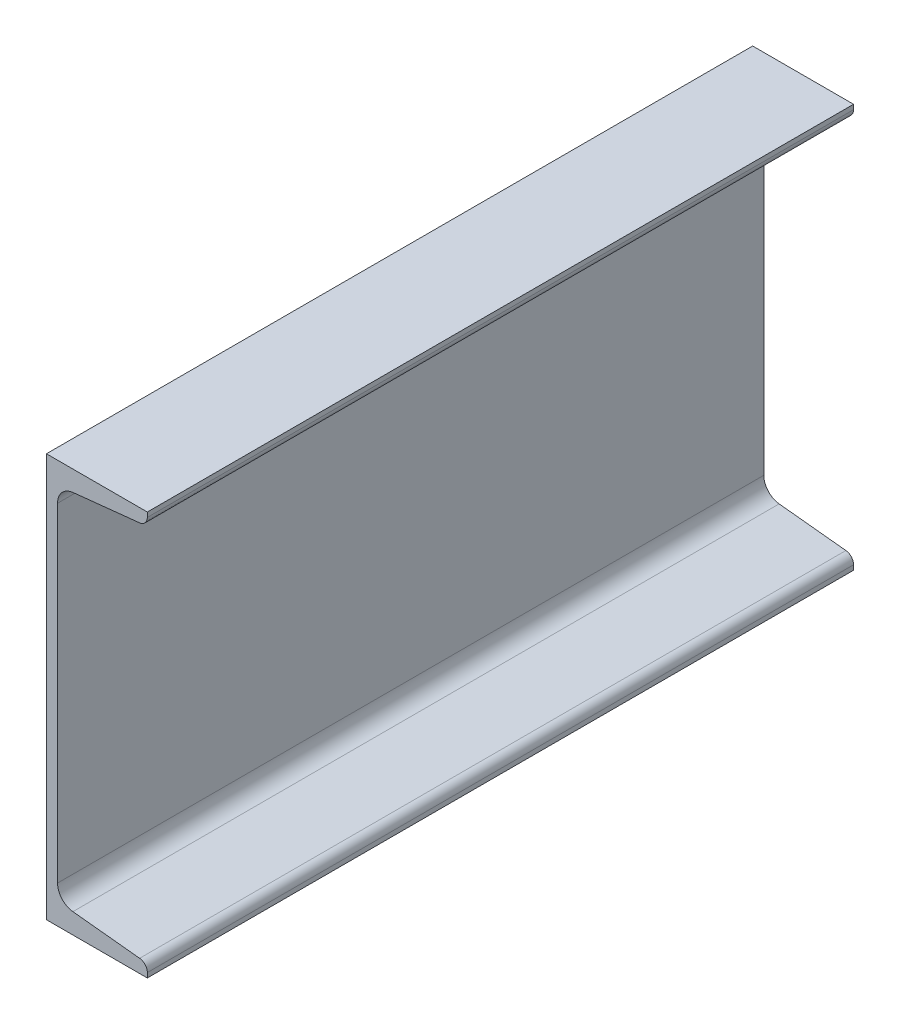
ISO-10303-21;
HEADER;
FILE_DESCRIPTION(('STEP AP214'),'2;1');
FILE_NAME('part.step','',(''),(''),'','','');
FILE_SCHEMA(('AUTOMOTIVE_DESIGN { 1 0 10303 214 1 1 1 1 }'));
ENDSEC;
DATA;
#1=APPLICATION_CONTEXT('core data for automotive mechanical design processes');
#2=APPLICATION_PROTOCOL_DEFINITION('international standard','automotive_design',2000,#1);
#3=PRODUCT_CONTEXT('',#1,'mechanical');
#4=PRODUCT('Part','Part','',(#3));
#5=PRODUCT_RELATED_PRODUCT_CATEGORY('part','',(#4));
#6=PRODUCT_DEFINITION_FORMATION('','',#4);
#7=PRODUCT_DEFINITION_CONTEXT('part definition',#1,'design');
#8=PRODUCT_DEFINITION('design','',#6,#7);
#9=PRODUCT_DEFINITION_SHAPE('','',#8);
#10=(LENGTH_UNIT() NAMED_UNIT(*) SI_UNIT(.MILLI.,.METRE.));
#11=(NAMED_UNIT(*) PLANE_ANGLE_UNIT() SI_UNIT($,.RADIAN.));
#12=(NAMED_UNIT(*) SI_UNIT($,.STERADIAN.) SOLID_ANGLE_UNIT());
#13=UNCERTAINTY_MEASURE_WITH_UNIT(LENGTH_MEASURE(1.E-05),#10,'distance_accuracy_value','');
#14=(GEOMETRIC_REPRESENTATION_CONTEXT(3) GLOBAL_UNCERTAINTY_ASSIGNED_CONTEXT((#13)) GLOBAL_UNIT_ASSIGNED_CONTEXT((#10,
#11,#12)) REPRESENTATION_CONTEXT('',''));
#15=CARTESIAN_POINT('',(0.,0.,0.));
#16=DIRECTION('',(0.,0.,1.));
#17=DIRECTION('',(1.,0.,0.));
#18=AXIS2_PLACEMENT_3D('',#15,#16,#17);
#19=CARTESIAN_POINT('',(1.24061045047754E-13,400.,350.));
#20=DIRECTION('',(1.,0.,0.));
#21=DIRECTION('',(0.,1.,0.));
#22=AXIS2_PLACEMENT_3D('',#19,#20,#21);
#23=PLANE('',#22);
#24=DIRECTION('',(0.,-1.,0.));
#25=VECTOR('',#24,1.);
#26=CARTESIAN_POINT('',(1.24061045047754E-13,400.,-350.));
#27=LINE('',#26,#25);
#28=CARTESIAN_POINT('',(1.24061045047754E-13,400.,-350.));
#29=VERTEX_POINT('',#28);
#30=CARTESIAN_POINT('',(0.,0.,-350.));
#31=VERTEX_POINT('',#30);
#32=EDGE_CURVE('E142',#29,#31,#27,.T.);
#33=ORIENTED_EDGE('',*,*,#32,.T.);
#34=DIRECTION('',(0.,0.,-1.));
#35=VECTOR('',#34,1.);
#36=CARTESIAN_POINT('',(0.,0.,350.));
#37=LINE('',#36,#35);
#38=CARTESIAN_POINT('',(0.,0.,350.));
#39=VERTEX_POINT('',#38);
#40=EDGE_CURVE('E140',#39,#31,#37,.T.);
#41=ORIENTED_EDGE('',*,*,#40,.F.);
#42=DIRECTION('',(0.,-1.,0.));
#43=VECTOR('',#42,1.);
#44=CARTESIAN_POINT('',(1.24061045047754E-13,400.,350.));
#45=LINE('',#44,#43);
#46=CARTESIAN_POINT('',(1.24061045047754E-13,400.,350.));
#47=VERTEX_POINT('',#46);
#48=EDGE_CURVE('E126',#47,#39,#45,.T.);
#49=ORIENTED_EDGE('',*,*,#48,.F.);
#50=DIRECTION('',(0.,0.,-1.));
#51=VECTOR('',#50,1.);
#52=CARTESIAN_POINT('',(1.24061045047754E-13,400.,350.));
#53=LINE('',#52,#51);
#54=EDGE_CURVE('E171',#47,#29,#53,.T.);
#55=ORIENTED_EDGE('',*,*,#54,.T.);
#56=EDGE_LOOP('',(#33,#41,#49,#55));
#57=FACE_BOUND('',#56,.T.);
#58=ADVANCED_FACE('F37',(#57),#23,.F.);
#59=CARTESIAN_POINT('',(100.,0.,350.));
#60=DIRECTION('',(0.,-1.,0.));
#61=DIRECTION('',(1.,0.,0.));
#62=AXIS2_PLACEMENT_3D('',#59,#60,#61);
#63=PLANE('',#62);
#64=DIRECTION('',(-1.,0.,0.));
#65=VECTOR('',#64,1.);
#66=CARTESIAN_POINT('',(100.,0.,-350.));
#67=LINE('',#66,#65);
#68=CARTESIAN_POINT('',(100.,0.,-350.));
#69=VERTEX_POINT('',#68);
#70=EDGE_CURVE('E173',#69,#31,#67,.T.);
#71=ORIENTED_EDGE('',*,*,#70,.F.);
#72=DIRECTION('',(0.,0.,-1.));
#73=VECTOR('',#72,1.);
#74=CARTESIAN_POINT('',(100.,0.,350.));
#75=LINE('',#74,#73);
#76=CARTESIAN_POINT('',(100.,0.,350.));
#77=VERTEX_POINT('',#76);
#78=EDGE_CURVE('E147',#77,#69,#75,.T.);
#79=ORIENTED_EDGE('',*,*,#78,.F.);
#80=DIRECTION('',(-1.,0.,0.));
#81=VECTOR('',#80,1.);
#82=CARTESIAN_POINT('',(100.,0.,350.));
#83=LINE('',#82,#81);
#84=EDGE_CURVE('E131',#77,#39,#83,.T.);
#85=ORIENTED_EDGE('',*,*,#84,.T.);
#86=ORIENTED_EDGE('',*,*,#40,.T.);
#87=EDGE_LOOP('',(#71,#79,#85,#86));
#88=FACE_BOUND('',#87,.T.);
#89=ADVANCED_FACE('F149',(#88),#63,.T.);
#90=CARTESIAN_POINT('',(100.,0.,350.));
#91=DIRECTION('',(-1.,0.,0.));
#92=DIRECTION('',(0.,-1.,0.));
#93=AXIS2_PLACEMENT_3D('',#90,#91,#92);
#94=PLANE('',#93);
#95=DIRECTION('',(0.,1.,0.));
#96=VECTOR('',#95,1.);
#97=CARTESIAN_POINT('',(100.,0.,-350.));
#98=LINE('',#97,#96);
#99=CARTESIAN_POINT('',(100.,4.66942715060426,-350.));
#100=VERTEX_POINT('',#99);
#101=EDGE_CURVE('E175',#69,#100,#98,.T.);
#102=ORIENTED_EDGE('',*,*,#101,.T.);
#103=DIRECTION('',(0.,0.,-1.));
#104=VECTOR('',#103,1.);
#105=CARTESIAN_POINT('',(100.,4.66942715060426,350.));
#106=LINE('',#105,#104);
#107=CARTESIAN_POINT('',(100.,4.66942715060426,350.));
#108=VERTEX_POINT('',#107);
#109=EDGE_CURVE('E214',#100,#108,#106,.F.);
#110=ORIENTED_EDGE('',*,*,#109,.T.);
#111=DIRECTION('',(0.,1.,0.));
#112=VECTOR('',#111,1.);
#113=CARTESIAN_POINT('',(100.,0.,350.));
#114=LINE('',#113,#112);
#115=EDGE_CURVE('E151',#77,#108,#114,.T.);
#116=ORIENTED_EDGE('',*,*,#115,.F.);
#117=ORIENTED_EDGE('',*,*,#78,.T.);
#118=EDGE_LOOP('',(#102,#110,#116,#117));
#119=FACE_BOUND('',#118,.T.);
#120=ADVANCED_FACE('F245',(#119),#94,.F.);
#121=CARTESIAN_POINT('',(26.22301612445,20.0771349975833,350.));
#122=DIRECTION('',(0.104528463267647,0.994521895368274,0.));
#123=DIRECTION('',(-0.994521895368274,0.104528463267647,0.));
#124=AXIS2_PLACEMENT_3D('',#121,#122,#123);
#125=PLANE('',#124);
#126=DIRECTION('',(0.994521895368274,-0.104528463267647,0.));
#127=VECTOR('',#126,1.);
#128=CARTESIAN_POINT('',(26.22301612445,20.0771349975833,350.));
#129=LINE('',#128,#127);
#130=CARTESIAN_POINT('',(26.22301612445,20.0771349975833,350.));
#131=VERTEX_POINT('',#130);
#132=CARTESIAN_POINT('',(92.388491937775,13.1228632612346,350.));
#133=VERTEX_POINT('',#132);
#134=EDGE_CURVE('E153',#131,#133,#129,.T.);
#135=ORIENTED_EDGE('',*,*,#134,.T.);
#136=DIRECTION('',(0.,0.,-1.));
#137=VECTOR('',#136,1.);
#138=CARTESIAN_POINT('',(92.388491937775,13.1228632612346,-350.));
#139=LINE('',#138,#137);
#140=CARTESIAN_POINT('',(92.388491937775,13.1228632612346,-350.));
#141=VERTEX_POINT('',#140);
#142=EDGE_CURVE('E146',#133,#141,#139,.T.);
#143=ORIENTED_EDGE('',*,*,#142,.T.);
#144=DIRECTION('',(0.994521895368274,-0.104528463267647,0.));
#145=VECTOR('',#144,1.);
#146=CARTESIAN_POINT('',(26.22301612445,20.0771349975833,-350.));
#147=LINE('',#146,#145);
#148=CARTESIAN_POINT('',(26.22301612445,20.0771349975833,-350.));
#149=VERTEX_POINT('',#148);
#150=EDGE_CURVE('E178',#149,#141,#147,.T.);
#151=ORIENTED_EDGE('',*,*,#150,.F.);
#152=DIRECTION('',(0.,0.,-1.));
#153=VECTOR('',#152,1.);
#154=CARTESIAN_POINT('',(26.22301612445,20.0771349975833,350.));
#155=LINE('',#154,#153);
#156=EDGE_CURVE('E205',#131,#149,#155,.T.);
#157=ORIENTED_EDGE('',*,*,#156,.F.);
#158=EDGE_LOOP('',(#135,#143,#151,#157));
#159=FACE_BOUND('',#158,.T.);
#160=ADVANCED_FACE('F261',(#159),#125,.T.);
#161=CARTESIAN_POINT('',(28.,36.9840072188439,350.));
#162=DIRECTION('',(0.,0.,-1.));
#163=DIRECTION('',(-1.,0.,0.));
#164=AXIS2_PLACEMENT_3D('',#161,#162,#163);
#165=CYLINDRICAL_SURFACE('',#164,17.);
#166=CARTESIAN_POINT('',(28.,36.9840072188439,-350.));
#167=DIRECTION('',(0.,0.,1.));
#168=DIRECTION('',(1.,0.,0.));
#169=AXIS2_PLACEMENT_3D('',#166,#167,#168);
#170=CIRCLE('',#169,17.);
#171=CARTESIAN_POINT('',(11.,36.984007218844,-350.));
#172=VERTEX_POINT('',#171);
#173=EDGE_CURVE('E181',#172,#149,#170,.T.);
#174=ORIENTED_EDGE('',*,*,#173,.F.);
#175=DIRECTION('',(0.,0.,-1.));
#176=VECTOR('',#175,1.);
#177=CARTESIAN_POINT('',(11.,36.984007218844,350.));
#178=LINE('',#177,#176);
#179=CARTESIAN_POINT('',(11.,36.984007218844,350.));
#180=VERTEX_POINT('',#179);
#181=EDGE_CURVE('E203',#180,#172,#178,.T.);
#182=ORIENTED_EDGE('',*,*,#181,.F.);
#183=CARTESIAN_POINT('',(28.,36.9840072188439,350.));
#184=DIRECTION('',(0.,0.,1.));
#185=DIRECTION('',(1.,0.,0.));
#186=AXIS2_PLACEMENT_3D('',#183,#184,#185);
#187=CIRCLE('',#186,17.);
#188=EDGE_CURVE('E158',#180,#131,#187,.T.);
#189=ORIENTED_EDGE('',*,*,#188,.T.);
#190=ORIENTED_EDGE('',*,*,#156,.T.);
#191=EDGE_LOOP('',(#174,#182,#189,#190));
#192=FACE_BOUND('',#191,.T.);
#193=ADVANCED_FACE('F265',(#192),#165,.F.);
#194=CARTESIAN_POINT('',(11.0000000000001,363.015992781156,350.));
#195=DIRECTION('',(1.,0.,0.));
#196=DIRECTION('',(0.,1.,0.));
#197=AXIS2_PLACEMENT_3D('',#194,#195,#196);
#198=PLANE('',#197);
#199=DIRECTION('',(0.,-1.,0.));
#200=VECTOR('',#199,1.);
#201=CARTESIAN_POINT('',(11.0000000000001,363.015992781156,-350.));
#202=LINE('',#201,#200);
#203=CARTESIAN_POINT('',(11.0000000000001,363.015992781156,-350.));
#204=VERTEX_POINT('',#203);
#205=EDGE_CURVE('E184',#204,#172,#202,.T.);
#206=ORIENTED_EDGE('',*,*,#205,.F.);
#207=DIRECTION('',(0.,0.,-1.));
#208=VECTOR('',#207,1.);
#209=CARTESIAN_POINT('',(11.0000000000001,363.015992781156,350.));
#210=LINE('',#209,#208);
#211=CARTESIAN_POINT('',(11.0000000000001,363.015992781156,350.));
#212=VERTEX_POINT('',#211);
#213=EDGE_CURVE('E201',#212,#204,#210,.T.);
#214=ORIENTED_EDGE('',*,*,#213,.F.);
#215=DIRECTION('',(0.,-1.,0.));
#216=VECTOR('',#215,1.);
#217=CARTESIAN_POINT('',(11.0000000000001,363.015992781156,350.));
#218=LINE('',#217,#216);
#219=EDGE_CURVE('E161',#212,#180,#218,.T.);
#220=ORIENTED_EDGE('',*,*,#219,.T.);
#221=ORIENTED_EDGE('',*,*,#181,.T.);
#222=EDGE_LOOP('',(#206,#214,#220,#221));
#223=FACE_BOUND('',#222,.T.);
#224=ADVANCED_FACE('F269',(#223),#198,.T.);
#225=CARTESIAN_POINT('',(28.0000000000001,363.015992781156,350.));
#226=DIRECTION('',(0.,0.,-1.));
#227=DIRECTION('',(-1.,0.,0.));
#228=AXIS2_PLACEMENT_3D('',#225,#226,#227);
#229=CYLINDRICAL_SURFACE('',#228,17.);
#230=CARTESIAN_POINT('',(28.0000000000001,363.015992781156,-350.));
#231=DIRECTION('',(0.,0.,-1.));
#232=DIRECTION('',(-1.,0.,0.));
#233=AXIS2_PLACEMENT_3D('',#230,#231,#232);
#234=CIRCLE('',#233,17.);
#235=CARTESIAN_POINT('',(26.2230161244501,379.922865002417,-350.));
#236=VERTEX_POINT('',#235);
#237=EDGE_CURVE('E187',#204,#236,#234,.T.);
#238=ORIENTED_EDGE('',*,*,#237,.T.);
#239=DIRECTION('',(0.,0.,-1.));
#240=VECTOR('',#239,1.);
#241=CARTESIAN_POINT('',(26.2230161244501,379.922865002417,350.));
#242=LINE('',#241,#240);
#243=CARTESIAN_POINT('',(26.2230161244501,379.922865002417,350.));
#244=VERTEX_POINT('',#243);
#245=EDGE_CURVE('E198',#244,#236,#242,.T.);
#246=ORIENTED_EDGE('',*,*,#245,.F.);
#247=CARTESIAN_POINT('',(28.0000000000001,363.015992781156,350.));
#248=DIRECTION('',(0.,0.,-1.));
#249=DIRECTION('',(-1.,0.,0.));
#250=AXIS2_PLACEMENT_3D('',#247,#248,#249);
#251=CIRCLE('',#250,17.);
#252=EDGE_CURVE('E164',#212,#244,#251,.T.);
#253=ORIENTED_EDGE('',*,*,#252,.F.);
#254=ORIENTED_EDGE('',*,*,#213,.T.);
#255=EDGE_LOOP('',(#238,#246,#253,#254));
#256=FACE_BOUND('',#255,.T.);
#257=ADVANCED_FACE('F274',(#256),#229,.F.);
#258=CARTESIAN_POINT('',(26.2230161244501,379.922865002417,350.));
#259=DIRECTION('',(-0.104528463267646,0.994521895368274,0.));
#260=DIRECTION('',(-0.994521895368274,-0.104528463267646,0.));
#261=AXIS2_PLACEMENT_3D('',#258,#259,#260);
#262=PLANE('',#261);
#263=DIRECTION('',(0.994521895368274,0.104528463267646,0.));
#264=VECTOR('',#263,1.);
#265=CARTESIAN_POINT('',(26.2230161244501,379.922865002417,-350.));
#266=LINE('',#265,#264);
#267=CARTESIAN_POINT('',(92.3884919377751,386.877136738765,-350.));
#268=VERTEX_POINT('',#267);
#269=EDGE_CURVE('E189',#236,#268,#266,.T.);
#270=ORIENTED_EDGE('',*,*,#269,.T.);
#271=DIRECTION('',(0.,0.,-1.));
#272=VECTOR('',#271,1.);
#273=CARTESIAN_POINT('',(92.3884919377751,386.877136738765,350.));
#274=LINE('',#273,#272);
#275=CARTESIAN_POINT('',(92.3884919377751,386.877136738765,350.));
#276=VERTEX_POINT('',#275);
#277=EDGE_CURVE('E11',#268,#276,#274,.F.);
#278=ORIENTED_EDGE('',*,*,#277,.T.);
#279=DIRECTION('',(0.994521895368274,0.104528463267646,0.));
#280=VECTOR('',#279,1.);
#281=CARTESIAN_POINT('',(26.2230161244501,379.922865002417,350.));
#282=LINE('',#281,#280);
#283=EDGE_CURVE('E166',#244,#276,#282,.T.);
#284=ORIENTED_EDGE('',*,*,#283,.F.);
#285=ORIENTED_EDGE('',*,*,#245,.T.);
#286=EDGE_LOOP('',(#270,#278,#284,#285));
#287=FACE_BOUND('',#286,.T.);
#288=ADVANCED_FACE('F237',(#287),#262,.F.);
#289=CARTESIAN_POINT('',(100.,400.,350.));
#290=DIRECTION('',(1.,0.,0.));
#291=DIRECTION('',(0.,1.,0.));
#292=AXIS2_PLACEMENT_3D('',#289,#290,#291);
#293=PLANE('',#292);
#294=DIRECTION('',(0.,-1.,0.));
#295=VECTOR('',#294,1.);
#296=CARTESIAN_POINT('',(100.,400.,350.));
#297=LINE('',#296,#295);
#298=CARTESIAN_POINT('',(100.,400.,350.));
#299=VERTEX_POINT('',#298);
#300=CARTESIAN_POINT('',(100.,395.330572849396,350.));
#301=VERTEX_POINT('',#300);
#302=EDGE_CURVE('E168',#299,#301,#297,.T.);
#303=ORIENTED_EDGE('',*,*,#302,.T.);
#304=DIRECTION('',(0.,0.,-1.));
#305=VECTOR('',#304,1.);
#306=CARTESIAN_POINT('',(100.,395.330572849396,-350.));
#307=LINE('',#306,#305);
#308=CARTESIAN_POINT('',(100.,395.330572849396,-350.));
#309=VERTEX_POINT('',#308);
#310=EDGE_CURVE('E45',#301,#309,#307,.T.);
#311=ORIENTED_EDGE('',*,*,#310,.T.);
#312=DIRECTION('',(0.,-1.,0.));
#313=VECTOR('',#312,1.);
#314=CARTESIAN_POINT('',(100.,400.,-350.));
#315=LINE('',#314,#313);
#316=CARTESIAN_POINT('',(100.,400.,-350.));
#317=VERTEX_POINT('',#316);
#318=EDGE_CURVE('E191',#317,#309,#315,.T.);
#319=ORIENTED_EDGE('',*,*,#318,.F.);
#320=DIRECTION('',(0.,0.,-1.));
#321=VECTOR('',#320,1.);
#322=CARTESIAN_POINT('',(100.,400.,350.));
#323=LINE('',#322,#321);
#324=EDGE_CURVE('E196',#299,#317,#323,.T.);
#325=ORIENTED_EDGE('',*,*,#324,.F.);
#326=EDGE_LOOP('',(#303,#311,#319,#325));
#327=FACE_BOUND('',#326,.T.);
#328=ADVANCED_FACE('F222',(#327),#293,.T.);
#329=CARTESIAN_POINT('',(100.,400.,350.));
#330=DIRECTION('',(0.,-1.,0.));
#331=DIRECTION('',(0.,0.,-1.));
#332=AXIS2_PLACEMENT_3D('',#329,#330,#331);
#333=PLANE('',#332);
#334=DIRECTION('',(-1.,0.,0.));
#335=VECTOR('',#334,1.);
#336=CARTESIAN_POINT('',(100.,400.,-350.));
#337=LINE('',#336,#335);
#338=EDGE_CURVE('E137',#317,#29,#337,.T.);
#339=ORIENTED_EDGE('',*,*,#338,.T.);
#340=ORIENTED_EDGE('',*,*,#54,.F.);
#341=DIRECTION('',(-1.,0.,0.));
#342=VECTOR('',#341,1.);
#343=CARTESIAN_POINT('',(100.,400.,350.));
#344=LINE('',#343,#342);
#345=EDGE_CURVE('E133',#299,#47,#344,.T.);
#346=ORIENTED_EDGE('',*,*,#345,.F.);
#347=ORIENTED_EDGE('',*,*,#324,.T.);
#348=EDGE_LOOP('',(#339,#340,#346,#347));
#349=FACE_BOUND('',#348,.T.);
#350=ADVANCED_FACE('F229',(#349),#333,.F.);
#351=CARTESIAN_POINT('',(28.,36.9840072188439,350.));
#352=DIRECTION('',(0.,0.,1.));
#353=DIRECTION('',(1.,0.,0.));
#354=AXIS2_PLACEMENT_3D('',#351,#352,#353);
#355=PLANE('',#354);
#356=ORIENTED_EDGE('',*,*,#115,.T.);
#357=CARTESIAN_POINT('',(91.5,4.66942715060426,350.));
#358=DIRECTION('',(0.,0.,1.));
#359=DIRECTION('',(1.,0.,0.));
#360=AXIS2_PLACEMENT_3D('',#357,#358,#359);
#361=CIRCLE('',#360,8.5);
#362=EDGE_CURVE('E217',#108,#133,#361,.T.);
#363=ORIENTED_EDGE('',*,*,#362,.T.);
#364=ORIENTED_EDGE('',*,*,#134,.F.);
#365=ORIENTED_EDGE('',*,*,#188,.F.);
#366=ORIENTED_EDGE('',*,*,#219,.F.);
#367=ORIENTED_EDGE('',*,*,#252,.T.);
#368=ORIENTED_EDGE('',*,*,#283,.T.);
#369=CARTESIAN_POINT('',(91.5000000000001,395.330572849396,350.));
#370=DIRECTION('',(0.,0.,1.));
#371=DIRECTION('',(1.,0.,0.));
#372=AXIS2_PLACEMENT_3D('',#369,#370,#371);
#373=CIRCLE('',#372,8.5);
#374=EDGE_CURVE('E52',#276,#301,#373,.T.);
#375=ORIENTED_EDGE('',*,*,#374,.T.);
#376=ORIENTED_EDGE('',*,*,#302,.F.);
#377=ORIENTED_EDGE('',*,*,#345,.T.);
#378=ORIENTED_EDGE('',*,*,#48,.T.);
#379=ORIENTED_EDGE('',*,*,#84,.F.);
#380=EDGE_LOOP('',(#356,#363,#364,#365,#366,#367,#368,#375,#376,#377,#378,#379));
#381=FACE_BOUND('',#380,.T.);
#382=ADVANCED_FACE('F129',(#381),#355,.T.);
#383=CARTESIAN_POINT('',(28.,36.9840072188439,-350.));
#384=DIRECTION('',(0.,0.,1.));
#385=DIRECTION('',(1.,0.,0.));
#386=AXIS2_PLACEMENT_3D('',#383,#384,#385);
#387=PLANE('',#386);
#388=ORIENTED_EDGE('',*,*,#150,.T.);
#389=CARTESIAN_POINT('',(91.5,4.66942715060426,-350.));
#390=DIRECTION('',(0.,0.,1.));
#391=DIRECTION('',(1.,0.,0.));
#392=AXIS2_PLACEMENT_3D('',#389,#390,#391);
#393=CIRCLE('',#392,8.5);
#394=EDGE_CURVE('E212',#141,#100,#393,.F.);
#395=ORIENTED_EDGE('',*,*,#394,.T.);
#396=ORIENTED_EDGE('',*,*,#101,.F.);
#397=ORIENTED_EDGE('',*,*,#70,.T.);
#398=ORIENTED_EDGE('',*,*,#32,.F.);
#399=ORIENTED_EDGE('',*,*,#338,.F.);
#400=ORIENTED_EDGE('',*,*,#318,.T.);
#401=CARTESIAN_POINT('',(91.5000000000001,395.330572849396,-350.));
#402=DIRECTION('',(0.,0.,1.));
#403=DIRECTION('',(1.,0.,0.));
#404=AXIS2_PLACEMENT_3D('',#401,#402,#403);
#405=CIRCLE('',#404,8.5);
#406=EDGE_CURVE('E210',#309,#268,#405,.F.);
#407=ORIENTED_EDGE('',*,*,#406,.T.);
#408=ORIENTED_EDGE('',*,*,#269,.F.);
#409=ORIENTED_EDGE('',*,*,#237,.F.);
#410=ORIENTED_EDGE('',*,*,#205,.T.);
#411=ORIENTED_EDGE('',*,*,#173,.T.);
#412=EDGE_LOOP('',(#388,#395,#396,#397,#398,#399,#400,#407,#408,#409,#410,#411));
#413=FACE_BOUND('',#412,.T.);
#414=ADVANCED_FACE('F226',(#413),#387,.F.);
#415=CARTESIAN_POINT('',(91.5,4.66942715060426,350.));
#416=DIRECTION('',(0.,0.,1.));
#417=DIRECTION('',(1.,0.,0.));
#418=AXIS2_PLACEMENT_3D('',#415,#416,#417);
#419=CYLINDRICAL_SURFACE('',#418,8.5);
#420=ORIENTED_EDGE('',*,*,#362,.F.);
#421=ORIENTED_EDGE('',*,*,#109,.F.);
#422=ORIENTED_EDGE('',*,*,#394,.F.);
#423=ORIENTED_EDGE('',*,*,#142,.F.);
#424=EDGE_LOOP('',(#420,#421,#422,#423));
#425=FACE_BOUND('',#424,.T.);
#426=ADVANCED_FACE('F248',(#425),#419,.T.);
#427=CARTESIAN_POINT('',(91.5000000000001,395.330572849396,350.));
#428=DIRECTION('',(0.,0.,1.));
#429=DIRECTION('',(1.,0.,0.));
#430=AXIS2_PLACEMENT_3D('',#427,#428,#429);
#431=CYLINDRICAL_SURFACE('',#430,8.5);
#432=ORIENTED_EDGE('',*,*,#374,.F.);
#433=ORIENTED_EDGE('',*,*,#277,.F.);
#434=ORIENTED_EDGE('',*,*,#406,.F.);
#435=ORIENTED_EDGE('',*,*,#310,.F.);
#436=EDGE_LOOP('',(#432,#433,#434,#435));
#437=FACE_BOUND('',#436,.T.);
#438=ADVANCED_FACE('F39',(#437),#431,.T.);
#439=CLOSED_SHELL('',(#58,#89,#120,#160,#193,#224,#257,#288,#328,#350,#382,#414,#426,#438));
#440=MANIFOLD_SOLID_BREP('B2',#439);
#441=ADVANCED_BREP_SHAPE_REPRESENTATION('',(#18,#440),#14);
#442=SHAPE_DEFINITION_REPRESENTATION(#9,#441);
ENDSEC;
END-ISO-10303-21;
